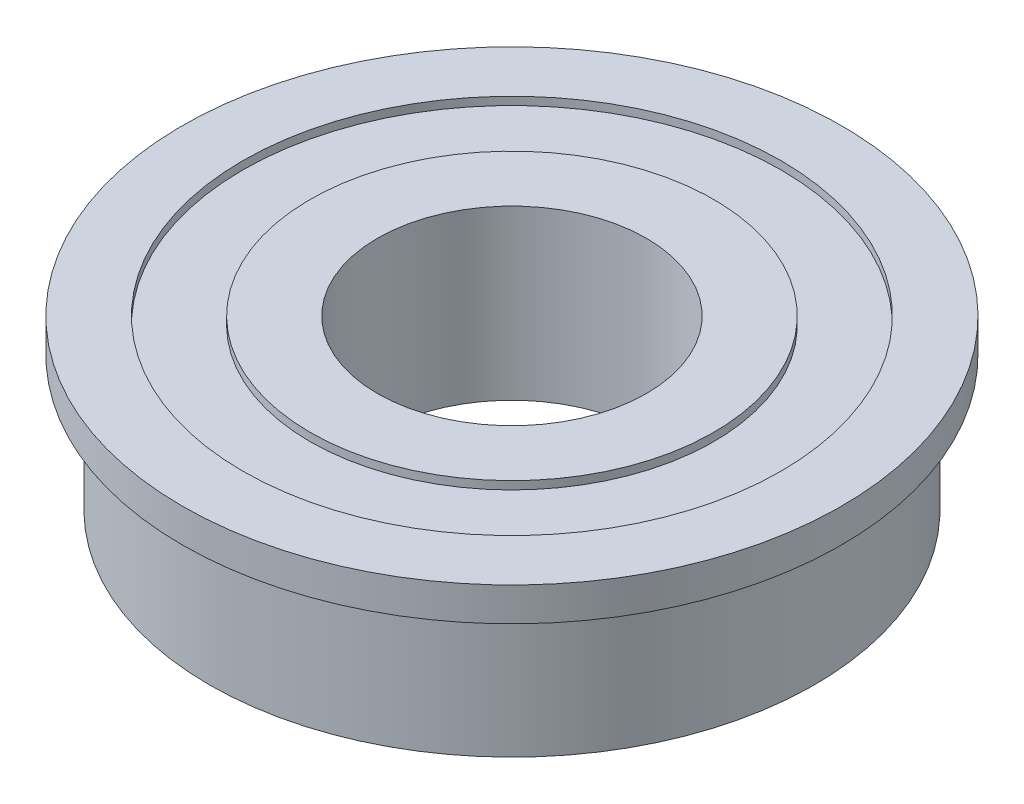
ISO-10303-21;
HEADER;
FILE_DESCRIPTION(('STEP AP214'),'2;1');
FILE_NAME('part.step','',(''),(''),'','','');
FILE_SCHEMA(('AUTOMOTIVE_DESIGN { 1 0 10303 214 1 1 1 1 }'));
ENDSEC;
DATA;
#1=APPLICATION_CONTEXT('core data for automotive mechanical design processes');
#2=APPLICATION_PROTOCOL_DEFINITION('international standard','automotive_design',2000,#1);
#3=PRODUCT_CONTEXT('',#1,'mechanical');
#4=PRODUCT('Part','Part','',(#3));
#5=PRODUCT_RELATED_PRODUCT_CATEGORY('part','',(#4));
#6=PRODUCT_DEFINITION_FORMATION('','',#4);
#7=PRODUCT_DEFINITION_CONTEXT('part definition',#1,'design');
#8=PRODUCT_DEFINITION('design','',#6,#7);
#9=PRODUCT_DEFINITION_SHAPE('','',#8);
#10=(LENGTH_UNIT() NAMED_UNIT(*) SI_UNIT(.MILLI.,.METRE.));
#11=(NAMED_UNIT(*) PLANE_ANGLE_UNIT() SI_UNIT($,.RADIAN.));
#12=(NAMED_UNIT(*) SI_UNIT($,.STERADIAN.) SOLID_ANGLE_UNIT());
#13=UNCERTAINTY_MEASURE_WITH_UNIT(LENGTH_MEASURE(1.E-05),#10,'distance_accuracy_value','');
#14=(GEOMETRIC_REPRESENTATION_CONTEXT(3) GLOBAL_UNCERTAINTY_ASSIGNED_CONTEXT((#13)) GLOBAL_UNIT_ASSIGNED_CONTEXT((#10,
#11,#12)) REPRESENTATION_CONTEXT('',''));
#15=CARTESIAN_POINT('',(0.,0.,0.));
#16=DIRECTION('',(0.,0.,1.));
#17=DIRECTION('',(1.,0.,0.));
#18=AXIS2_PLACEMENT_3D('',#15,#16,#17);
#19=CARTESIAN_POINT('',(0.,0.,0.));
#20=DIRECTION('',(0.,1.,0.));
#21=DIRECTION('',(0.,0.,1.));
#22=AXIS2_PLACEMENT_3D('',#19,#20,#21);
#23=CYLINDRICAL_SURFACE('',#22,12.7);
#24=CARTESIAN_POINT('',(0.,7.9375,0.));
#25=DIRECTION('',(0.,1.,0.));
#26=DIRECTION('',(0.,0.,1.));
#27=AXIS2_PLACEMENT_3D('',#24,#25,#26);
#28=CIRCLE('',#27,12.7);
#29=CARTESIAN_POINT('',(0.,7.9375,12.7));
#30=VERTEX_POINT('',#29);
#31=EDGE_CURVE('E46',#30,#30,#28,.F.);
#32=ORIENTED_EDGE('',*,*,#31,.F.);
#33=EDGE_LOOP('',(#32));
#34=FACE_BOUND('',#33,.T.);
#35=CARTESIAN_POINT('',(0.,7.5565,0.));
#36=DIRECTION('',(0.,1.,0.));
#37=DIRECTION('',(0.,0.,1.));
#38=AXIS2_PLACEMENT_3D('',#35,#36,#37);
#39=CIRCLE('',#38,12.7);
#40=CARTESIAN_POINT('',(0.,7.5565,12.7));
#41=VERTEX_POINT('',#40);
#42=EDGE_CURVE('E18',#41,#41,#39,.T.);
#43=ORIENTED_EDGE('',*,*,#42,.F.);
#44=EDGE_LOOP('',(#43));
#45=FACE_BOUND('',#44,.T.);
#46=ADVANCED_FACE('F15',(#34,#45),#23,.F.);
#47=CARTESIAN_POINT('',(9.525,7.5565,0.));
#48=DIRECTION('',(0.,1.,0.));
#49=DIRECTION('',(0.,0.,1.));
#50=AXIS2_PLACEMENT_3D('',#47,#48,#49);
#51=PLANE('',#50);
#52=CARTESIAN_POINT('',(0.,7.5565,0.));
#53=DIRECTION('',(0.,1.,0.));
#54=DIRECTION('',(0.,0.,1.));
#55=AXIS2_PLACEMENT_3D('',#52,#53,#54);
#56=CIRCLE('',#55,9.525);
#57=CARTESIAN_POINT('',(0.,7.5565,9.525));
#58=VERTEX_POINT('',#57);
#59=EDGE_CURVE('E44',#58,#58,#56,.T.);
#60=ORIENTED_EDGE('',*,*,#59,.F.);
#61=EDGE_LOOP('',(#60));
#62=FACE_BOUND('',#61,.T.);
#63=ORIENTED_EDGE('',*,*,#42,.T.);
#64=EDGE_LOOP('',(#63));
#65=FACE_BOUND('',#64,.T.);
#66=ADVANCED_FACE('F53',(#62,#65),#51,.T.);
#67=CARTESIAN_POINT('',(12.7,7.9375,0.));
#68=DIRECTION('',(0.,1.,0.));
#69=DIRECTION('',(0.,0.,1.));
#70=AXIS2_PLACEMENT_3D('',#67,#68,#69);
#71=PLANE('',#70);
#72=ORIENTED_EDGE('',*,*,#31,.T.);
#73=EDGE_LOOP('',(#72));
#74=FACE_BOUND('',#73,.T.);
#75=CARTESIAN_POINT('',(0.,7.9375,0.));
#76=DIRECTION('',(0.,1.,0.));
#77=DIRECTION('',(0.,0.,1.));
#78=AXIS2_PLACEMENT_3D('',#75,#76,#77);
#79=CIRCLE('',#78,15.5575);
#80=CARTESIAN_POINT('',(0.,7.9375,15.5575));
#81=VERTEX_POINT('',#80);
#82=EDGE_CURVE('E41',#81,#81,#79,.F.);
#83=ORIENTED_EDGE('',*,*,#82,.F.);
#84=EDGE_LOOP('',(#83));
#85=FACE_BOUND('',#84,.T.);
#86=ADVANCED_FACE('F61',(#74,#85),#71,.T.);
#87=CARTESIAN_POINT('',(0.,0.,0.));
#88=DIRECTION('',(0.,1.,0.));
#89=DIRECTION('',(0.,0.,1.));
#90=AXIS2_PLACEMENT_3D('',#87,#88,#89);
#91=CYLINDRICAL_SURFACE('',#90,9.525);
#92=ORIENTED_EDGE('',*,*,#59,.T.);
#93=EDGE_LOOP('',(#92));
#94=FACE_BOUND('',#93,.T.);
#95=CARTESIAN_POINT('',(0.,7.9375,0.));
#96=DIRECTION('',(0.,1.,0.));
#97=DIRECTION('',(0.,0.,1.));
#98=AXIS2_PLACEMENT_3D('',#95,#96,#97);
#99=CIRCLE('',#98,9.525);
#100=CARTESIAN_POINT('',(0.,7.9375,9.525));
#101=VERTEX_POINT('',#100);
#102=EDGE_CURVE('E38',#101,#101,#99,.T.);
#103=ORIENTED_EDGE('',*,*,#102,.F.);
#104=EDGE_LOOP('',(#103));
#105=FACE_BOUND('',#104,.T.);
#106=ADVANCED_FACE('F90',(#94,#105),#91,.T.);
#107=CARTESIAN_POINT('',(0.,0.,0.));
#108=DIRECTION('',(0.,1.,0.));
#109=DIRECTION('',(0.,0.,1.));
#110=AXIS2_PLACEMENT_3D('',#107,#108,#109);
#111=CYLINDRICAL_SURFACE('',#110,15.5575);
#112=CARTESIAN_POINT('',(0.,6.35,0.));
#113=DIRECTION('',(0.,1.,0.));
#114=DIRECTION('',(0.,0.,1.));
#115=AXIS2_PLACEMENT_3D('',#112,#113,#114);
#116=CIRCLE('',#115,15.5575);
#117=CARTESIAN_POINT('',(0.,6.35,15.5575));
#118=VERTEX_POINT('',#117);
#119=EDGE_CURVE('E35',#118,#118,#116,.F.);
#120=ORIENTED_EDGE('',*,*,#119,.F.);
#121=EDGE_LOOP('',(#120));
#122=FACE_BOUND('',#121,.T.);
#123=ORIENTED_EDGE('',*,*,#82,.T.);
#124=EDGE_LOOP('',(#123));
#125=FACE_BOUND('',#124,.T.);
#126=ADVANCED_FACE('F86',(#122,#125),#111,.T.);
#127=CARTESIAN_POINT('',(6.35,7.9375,0.));
#128=DIRECTION('',(0.,1.,0.));
#129=DIRECTION('',(0.,0.,1.));
#130=AXIS2_PLACEMENT_3D('',#127,#128,#129);
#131=PLANE('',#130);
#132=CARTESIAN_POINT('',(0.,7.9375,0.));
#133=DIRECTION('',(0.,1.,0.));
#134=DIRECTION('',(0.,0.,1.));
#135=AXIS2_PLACEMENT_3D('',#132,#133,#134);
#136=CIRCLE('',#135,6.35);
#137=CARTESIAN_POINT('',(0.,7.9375,6.35));
#138=VERTEX_POINT('',#137);
#139=EDGE_CURVE('E32',#138,#138,#136,.F.);
#140=ORIENTED_EDGE('',*,*,#139,.T.);
#141=EDGE_LOOP('',(#140));
#142=FACE_BOUND('',#141,.T.);
#143=ORIENTED_EDGE('',*,*,#102,.T.);
#144=EDGE_LOOP('',(#143));
#145=FACE_BOUND('',#144,.T.);
#146=ADVANCED_FACE('F82',(#142,#145),#131,.T.);
#147=CARTESIAN_POINT('',(15.5575,6.35,0.));
#148=DIRECTION('',(0.,-1.,0.));
#149=DIRECTION('',(0.,0.,-1.));
#150=AXIS2_PLACEMENT_3D('',#147,#148,#149);
#151=PLANE('',#150);
#152=ORIENTED_EDGE('',*,*,#119,.T.);
#153=EDGE_LOOP('',(#152));
#154=FACE_BOUND('',#153,.T.);
#155=CARTESIAN_POINT('',(0.,6.35,0.));
#156=DIRECTION('',(0.,1.,0.));
#157=DIRECTION('',(0.,0.,1.));
#158=AXIS2_PLACEMENT_3D('',#155,#156,#157);
#159=CIRCLE('',#158,14.2875);
#160=CARTESIAN_POINT('',(0.,6.35,14.2875));
#161=VERTEX_POINT('',#160);
#162=EDGE_CURVE('E27',#161,#161,#159,.F.);
#163=ORIENTED_EDGE('',*,*,#162,.F.);
#164=EDGE_LOOP('',(#163));
#165=FACE_BOUND('',#164,.T.);
#166=ADVANCED_FACE('F78',(#154,#165),#151,.T.);
#167=CARTESIAN_POINT('',(0.,0.,0.));
#168=DIRECTION('',(0.,1.,0.));
#169=DIRECTION('',(0.,0.,1.));
#170=AXIS2_PLACEMENT_3D('',#167,#168,#169);
#171=CYLINDRICAL_SURFACE('',#170,6.35);
#172=ORIENTED_EDGE('',*,*,#139,.F.);
#173=EDGE_LOOP('',(#172));
#174=FACE_BOUND('',#173,.T.);
#175=CARTESIAN_POINT('',(0.,0.,0.));
#176=DIRECTION('',(0.,1.,0.));
#177=DIRECTION('',(0.,0.,1.));
#178=AXIS2_PLACEMENT_3D('',#175,#176,#177);
#179=CIRCLE('',#178,6.35);
#180=CARTESIAN_POINT('',(0.,0.,6.35));
#181=VERTEX_POINT('',#180);
#182=EDGE_CURVE('E22',#181,#181,#179,.T.);
#183=ORIENTED_EDGE('',*,*,#182,.F.);
#184=EDGE_LOOP('',(#183));
#185=FACE_BOUND('',#184,.T.);
#186=ADVANCED_FACE('F71',(#174,#185),#171,.F.);
#187=CARTESIAN_POINT('',(0.,0.,0.));
#188=DIRECTION('',(0.,1.,0.));
#189=DIRECTION('',(0.,0.,1.));
#190=AXIS2_PLACEMENT_3D('',#187,#188,#189);
#191=CYLINDRICAL_SURFACE('',#190,14.2875);
#192=CARTESIAN_POINT('',(0.,0.,0.));
#193=DIRECTION('',(0.,1.,0.));
#194=DIRECTION('',(0.,0.,1.));
#195=AXIS2_PLACEMENT_3D('',#192,#193,#194);
#196=CIRCLE('',#195,14.2875);
#197=CARTESIAN_POINT('',(0.,0.,14.2875));
#198=VERTEX_POINT('',#197);
#199=EDGE_CURVE('E10',#198,#198,#196,.F.);
#200=ORIENTED_EDGE('',*,*,#199,.F.);
#201=EDGE_LOOP('',(#200));
#202=FACE_BOUND('',#201,.T.);
#203=ORIENTED_EDGE('',*,*,#162,.T.);
#204=EDGE_LOOP('',(#203));
#205=FACE_BOUND('',#204,.T.);
#206=ADVANCED_FACE('F65',(#202,#205),#191,.T.);
#207=CARTESIAN_POINT('',(14.2875,0.,0.));
#208=DIRECTION('',(0.,-1.,0.));
#209=DIRECTION('',(0.,0.,-1.));
#210=AXIS2_PLACEMENT_3D('',#207,#208,#209);
#211=PLANE('',#210);
#212=ORIENTED_EDGE('',*,*,#199,.T.);
#213=EDGE_LOOP('',(#212));
#214=FACE_BOUND('',#213,.T.);
#215=ORIENTED_EDGE('',*,*,#182,.T.);
#216=EDGE_LOOP('',(#215));
#217=FACE_BOUND('',#216,.T.);
#218=ADVANCED_FACE('F63',(#214,#217),#211,.T.);
#219=CLOSED_SHELL('',(#46,#66,#86,#106,#126,#146,#166,#186,#206,#218));
#220=MANIFOLD_SOLID_BREP('B1',#219);
#221=ADVANCED_BREP_SHAPE_REPRESENTATION('',(#18,#220),#14);
#222=SHAPE_DEFINITION_REPRESENTATION(#9,#221);
ENDSEC;
END-ISO-10303-21;
